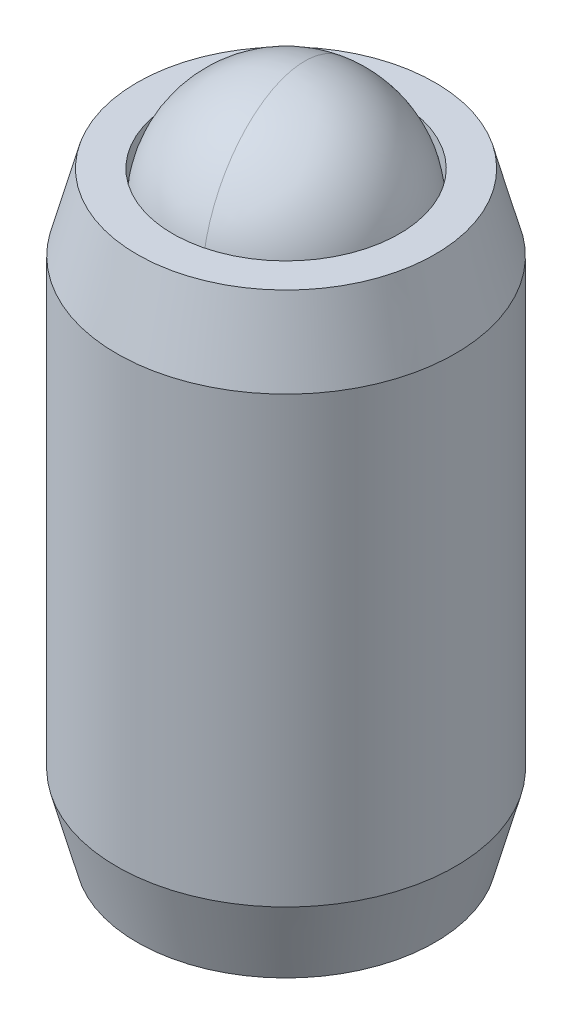
ISO-10303-21;
HEADER;
FILE_DESCRIPTION(('STEP AP214'),'2;1');
FILE_NAME('part.step','',(''),(''),'','','');
FILE_SCHEMA(('AUTOMOTIVE_DESIGN { 1 0 10303 214 1 1 1 1 }'));
ENDSEC;
DATA;
#1=APPLICATION_CONTEXT('core data for automotive mechanical design processes');
#2=APPLICATION_PROTOCOL_DEFINITION('international standard','automotive_design',2000,#1);
#3=PRODUCT_CONTEXT('',#1,'mechanical');
#4=PRODUCT('Part','Part','',(#3));
#5=PRODUCT_RELATED_PRODUCT_CATEGORY('part','',(#4));
#6=PRODUCT_DEFINITION_FORMATION('','',#4);
#7=PRODUCT_DEFINITION_CONTEXT('part definition',#1,'design');
#8=PRODUCT_DEFINITION('design','',#6,#7);
#9=PRODUCT_DEFINITION_SHAPE('','',#8);
#10=(LENGTH_UNIT() NAMED_UNIT(*) SI_UNIT(.MILLI.,.METRE.));
#11=(NAMED_UNIT(*) PLANE_ANGLE_UNIT() SI_UNIT($,.RADIAN.));
#12=(NAMED_UNIT(*) SI_UNIT($,.STERADIAN.) SOLID_ANGLE_UNIT());
#13=UNCERTAINTY_MEASURE_WITH_UNIT(LENGTH_MEASURE(1.E-05),#10,'distance_accuracy_value','');
#14=(GEOMETRIC_REPRESENTATION_CONTEXT(3) GLOBAL_UNCERTAINTY_ASSIGNED_CONTEXT((#13)) GLOBAL_UNIT_ASSIGNED_CONTEXT((#10,
#11,#12)) REPRESENTATION_CONTEXT('',''));
#15=CARTESIAN_POINT('',(0.,0.,0.));
#16=DIRECTION('',(0.,0.,1.));
#17=DIRECTION('',(1.,0.,0.));
#18=AXIS2_PLACEMENT_3D('',#15,#16,#17);
#19=CARTESIAN_POINT('',(3.71435257080567,-0.169252373948007,7.32758067099212));
#20=DIRECTION('',(0.,-1.,0.));
#21=DIRECTION('',(1.,0.,0.));
#22=AXIS2_PLACEMENT_3D('',#19,#20,#21);
#23=CONICAL_SURFACE('',#22,0.,0.78539816339745);
#24=CARTESIAN_POINT('',(3.71435257080567,-1.312252373948,7.32758067099212));
#25=DIRECTION('',(0.,1.,0.));
#26=DIRECTION('',(-1.,0.,0.));
#27=AXIS2_PLACEMENT_3D('',#24,#25,#26);
#28=CIRCLE('',#27,1.143);
#29=CARTESIAN_POINT('',(4.85734308213152,-1.312252373948,7.32292330917763));
#30=VERTEX_POINT('',#29);
#31=CARTESIAN_POINT('',(4.28988122011456,-1.312252373948,6.34005053280662));
#32=VERTEX_POINT('',#31);
#33=EDGE_CURVE('P0_E239',#30,#32,#28,.T.);
#34=ORIENTED_EDGE('',*,*,#33,.F.);
#35=CARTESIAN_POINT('',(4.85755257080567,-1.31246044025721,7.32328615420486));
#36=CARTESIAN_POINT('',(4.85754986438433,-1.31245775146451,7.3232814665456));
#37=CARTESIAN_POINT('',(4.85754715795709,-1.31245506269477,7.3232767788761));
#38=CARTESIAN_POINT('',(4.83805482766359,-1.29309011366432,7.28951507245068));
#39=CARTESIAN_POINT('',(4.81825873139563,-1.27491870956994,7.25522722792244));
#40=CARTESIAN_POINT('',(4.77799739364414,-1.24171882862372,7.18549254535573));
#41=CARTESIAN_POINT('',(4.75753178511991,-1.22669211031043,7.15004507158411));
#42=CARTESIAN_POINT('',(4.71600080261103,-1.20074837151425,7.07811129979059));
#43=CARTESIAN_POINT('',(4.69493706288189,-1.18982113088316,7.04162783238228));
#44=CARTESIAN_POINT('',(4.65231870342838,-1.17298459988489,6.96781066847354));
#45=CARTESIAN_POINT('',(4.63076462297386,-1.16707004690137,6.93047790601588));
#46=CARTESIAN_POINT('',(4.59359040392862,-1.16175968433041,6.86609026989785));
#47=CARTESIAN_POINT('',(4.57801755741396,-1.16099258245666,6.83911730851598));
#48=CARTESIAN_POINT('',(4.54690337232681,-1.16238845913065,6.78522595910893));
#49=CARTESIAN_POINT('',(4.53136204124561,-1.16455206746885,6.75830758405905));
#50=CARTESIAN_POINT('',(4.48495311681086,-1.17529458412025,6.67792496901343));
#51=CARTESIAN_POINT('',(4.45431847467133,-1.18812754847032,6.62486421235607));
#52=CARTESIAN_POINT('',(4.40110957793214,-1.21875261376539,6.53270369978911));
#53=CARTESIAN_POINT('',(4.37826334517805,-1.23479673860561,6.49313286389749));
#54=CARTESIAN_POINT('',(4.3333801606429,-1.27088743498856,6.41539290787712));
#55=CARTESIAN_POINT('',(4.31134330532398,-1.29093448178141,6.3772239548257));
#56=CARTESIAN_POINT('',(4.26825727765103,-1.3337310031301,6.30259676579983));
#57=CARTESIAN_POINT('',(4.24719984758599,-1.35644795012112,6.26612422705036));
#58=CARTESIAN_POINT('',(4.20577545952448,-1.40397145525448,6.19437508225537));
#59=CARTESIAN_POINT('',(4.18540637799066,-1.42877056660556,6.15909479813528));
#60=CARTESIAN_POINT('',(4.16528979504526,-1.45429891825988,6.12425185439917));
#61=B_SPLINE_CURVE_WITH_KNOTS('',3,(#35,#36,#37,#38,#39,#40,#41,#42,#43,#44,#45,#46,#47,#48,#49,
#50,#51,#52,#53,#54,#55,#56,#57,#58,#59,#60),.UNSPECIFIED.,.F.,.F.,(4,2,2,2,2,2,2,2,2,2,2,2,4),
(0.,1.81316377689297E-05,0.13058806615112,0.26123082266155,0.391545682806626,0.521723560618482,
0.615053768986273,0.708404036587446,0.895210399439815,1.04029045702031,1.18538774959988,
1.32887166801422,1.47186265945493),.UNSPECIFIED.);
#62=EDGE_CURVE('P0_E11',#30,#32,#61,.T.);
#63=ORIENTED_EDGE('',*,*,#62,.T.);
#64=EDGE_LOOP('',(#34,#63));
#65=FACE_BOUND('',#64,.T.);
#66=ADVANCED_FACE('P0_F17',(#65),#23,.F.);
#67=CARTESIAN_POINT('',(4.28181443282263,-1.312252373948,6.33539317099212));
#68=VERTEX_POINT('',#67);
#69=CARTESIAN_POINT('',(3.14689070878871,-1.312252373948,6.33539317099212));
#70=VERTEX_POINT('',#69);
#71=EDGE_CURVE('P0_E243',#68,#70,#28,.T.);
#72=ORIENTED_EDGE('',*,*,#71,.F.);
#73=CARTESIAN_POINT('',(2.57372176316856,-1.68103101994322,6.33539317099212));
#74=CARTESIAN_POINT('',(2.60150372982532,-1.66007283389546,6.33539317099212));
#75=CARTESIAN_POINT('',(2.62944069716268,-1.6393206926479,6.33539317099212));
#76=CARTESIAN_POINT('',(2.68568744790622,-1.59831355553451,6.33539317099212));
#77=CARTESIAN_POINT('',(2.71399732269767,-1.57805868514923,6.33539317099212));
#78=CARTESIAN_POINT('',(2.7999950069665,-1.51787856454166,6.33539317099212));
#79=CARTESIAN_POINT('',(2.85832845299474,-1.4788606224406,6.33539317099212));
#80=CARTESIAN_POINT('',(2.98063953213059,-1.4022805999482,6.33539317099212));
#81=CARTESIAN_POINT('',(3.04474949547022,-1.36492746348765,6.33539317099212));
#82=CARTESIAN_POINT('',(3.17616921465741,-1.29661239894251,6.33539317099212));
#83=CARTESIAN_POINT('',(3.24346720486202,-1.26562892762012,6.33539317099212));
#84=CARTESIAN_POINT('',(3.34449980237117,-1.22772408351047,6.33539317099212));
#85=CARTESIAN_POINT('',(3.37674251856021,-1.21684204174321,6.33539317099212));
#86=CARTESIAN_POINT('',(3.44200473919978,-1.19766674273306,6.33539317099212));
#87=CARTESIAN_POINT('',(3.47502429714999,-1.18937366435188,6.33539317099212));
#88=CARTESIAN_POINT('',(3.5410867615159,-1.175945731472,6.33539317099212));
#89=CARTESIAN_POINT('',(3.5741184243205,-1.17075642188746,6.33539317099212));
#90=CARTESIAN_POINT('',(3.64054375640494,-1.16363372601876,6.33539317099212));
#91=CARTESIAN_POINT('',(3.67393748056284,-1.16170084045924,6.33539317099212));
#92=CARTESIAN_POINT('',(3.73954685398962,-1.16123692460889,6.33539317099212));
#93=CARTESIAN_POINT('',(3.7717616978466,-1.16258609816448,6.33539317099212));
#94=CARTESIAN_POINT('',(3.83590382532484,-1.16834705721685,6.33539317099212));
#95=CARTESIAN_POINT('',(3.86783117322682,-1.17275813997068,6.33539317099212));
#96=CARTESIAN_POINT('',(3.93172366681495,-1.18447722315108,6.33539317099212));
#97=CARTESIAN_POINT('',(3.96367955978926,-1.19183491392615,6.33539317099212));
#98=CARTESIAN_POINT('',(4.02689335168815,-1.20905668681501,6.33539317099212));
#99=CARTESIAN_POINT('',(4.05815130940814,-1.21892055693022,6.33539317099212));
#100=CARTESIAN_POINT('',(4.15664812524377,-1.25371093295435,6.33539317099212));
#101=CARTESIAN_POINT('',(4.22248283967945,-1.28260315858406,6.33539317099212));
#102=CARTESIAN_POINT('',(4.35105872838445,-1.3468390583077,6.33539317099212));
#103=CARTESIAN_POINT('',(4.41378771559752,-1.38220592765967,6.33539317099212));
#104=CARTESIAN_POINT('',(4.53367058628006,-1.45516824363566,6.33539317099212));
#105=CARTESIAN_POINT('',(4.59094659859076,-1.49256550481214,6.33539317099212));
#106=CARTESIAN_POINT('',(4.67533131614639,-1.55037667290736,6.33539317099212));
#107=CARTESIAN_POINT('',(4.70309531571387,-1.56985068399867,6.33539317099212));
#108=CARTESIAN_POINT('',(4.75824399077057,-1.60931345693125,6.33539317099212));
#109=CARTESIAN_POINT('',(4.78562876790362,-1.62930207656683,6.33539317099212));
#110=CARTESIAN_POINT('',(4.81285565499193,-1.64950406238581,6.33539317099212));
#111=B_SPLINE_CURVE_WITH_KNOTS('',3,(#73,#74,#75,#76,#77,#78,#79,#80,#81,#82,#83,#84,#85,#86,
#87,#88,#89,#90,#91,#92,#93,#94,#95,#96,#97,#98,#99,#100,#101,#102,#103,#104,#105,#106,#107,
#108,#109,#110),.UNSPECIFIED.,.F.,.F.,(4,2,2,2,2,2,2,2,2,2,2,2,2,2,2,2,2,2,4),(0.,
0.104399205750146,0.20882449015393,0.4192690376076,0.641680044169887,0.863325974887584,
0.965328311414921,1.06733769333986,1.16750041530699,1.26767853740811,1.3642553320756,
1.46080996859686,1.55906646638462,1.65731465538659,1.87236816316003,2.08820773237251,
2.29331760239731,2.39505206150513,2.49675870307946),.UNSPECIFIED.);
#112=EDGE_CURVE('P0_E30',#68,#70,#111,.F.);
#113=ORIENTED_EDGE('',*,*,#112,.T.);
#114=EDGE_LOOP('',(#72,#113));
#115=FACE_BOUND('',#114,.T.);
#116=ADVANCED_FACE('P0_F230',(#115),#23,.F.);
#117=CARTESIAN_POINT('',(3.13882392149677,-1.312252373948,6.34005053280662));
#118=VERTEX_POINT('',#117);
#119=CARTESIAN_POINT('',(2.57136205947982,-1.312252373948,7.32292330917763));
#120=VERTEX_POINT('',#119);
#121=EDGE_CURVE('P0_E162',#118,#120,#28,.T.);
#122=ORIENTED_EDGE('',*,*,#121,.F.);
#123=CARTESIAN_POINT('',(3.26341534656608,-1.45429891825988,6.12425185439917));
#124=CARTESIAN_POINT('',(3.24343759340995,-1.42894522835127,6.15885433788667));
#125=CARTESIAN_POINT('',(3.22320845147875,-1.40431002062132,6.19389223950502));
#126=CARTESIAN_POINT('',(3.18179090792657,-1.35675647710123,6.26562952926209));
#127=CARTESIAN_POINT('',(3.16059198952446,-1.3338749800858,6.30234713300005));
#128=CARTESIAN_POINT('',(3.11945187209737,-1.29300973005343,6.37360390661313));
#129=CARTESIAN_POINT('',(3.09957551484011,-1.27476876619436,6.40803076725208));
#130=CARTESIAN_POINT('',(3.05915205026837,-1.2414646952883,6.47804626170831));
#131=CARTESIAN_POINT('',(3.03860481589536,-1.2264021942943,6.51363511559737));
#132=CARTESIAN_POINT('',(2.9970680987738,-1.20052561737435,6.58557882003154));
#133=CARTESIAN_POINT('',(2.97608526696165,-1.18966976423615,6.62192215081685));
#134=CARTESIAN_POINT('',(2.9336315074221,-1.17293830977722,6.69545421931167));
#135=CARTESIAN_POINT('',(2.91216106622551,-1.16705795036444,6.73264211432507));
#136=CARTESIAN_POINT('',(2.87508221121632,-1.1617612802309,6.79686457508748));
#137=CARTESIAN_POINT('',(2.85952040313229,-1.16099365163671,6.82381841734665));
#138=CARTESIAN_POINT('',(2.8284281507379,-1.16238443031327,6.87767177821549));
#139=CARTESIAN_POINT('',(2.81289771375483,-1.1645434563006,6.90457128413391));
#140=CARTESIAN_POINT('',(2.76647746556835,-1.1752764305586,6.98497351249285));
#141=CARTESIAN_POINT('',(2.7358212112753,-1.18811455442499,7.03807170249816));
#142=CARTESIAN_POINT('',(2.6826041173518,-1.21874503163673,7.13024641300483));
#143=CARTESIAN_POINT('',(2.6597703232217,-1.23477928247632,7.16979570456774));
#144=CARTESIAN_POINT('',(2.62611488331747,-1.26183638471471,7.22808863643294));
#145=CARTESIAN_POINT('',(2.61498692161902,-1.27136522965478,7.24736283147935));
#146=CARTESIAN_POINT('',(2.59292890112993,-1.29129000483631,7.28556844368084));
#147=CARTESIAN_POINT('',(2.58199881718583,-1.30168582391591,7.30449990440302));
#148=CARTESIAN_POINT('',(2.54792046091,-1.33553912020257,7.36352534891118));
#149=CARTESIAN_POINT('',(2.52510305258668,-1.36033050059066,7.40304625942421));
#150=CARTESIAN_POINT('',(2.48017571748318,-1.41237244073279,7.48086268647215));
#151=CARTESIAN_POINT('',(2.45806621813538,-1.43962444963929,7.51915746267245));
#152=CARTESIAN_POINT('',(2.41436568918583,-1.49600788150844,7.59484899913071));
#153=CARTESIAN_POINT('',(2.39277638199246,-1.52514461294509,7.63224277608985));
#154=CARTESIAN_POINT('',(2.35006936753153,-1.58477360733416,7.70621349497575));
#155=CARTESIAN_POINT('',(2.32895173425738,-1.61526608075448,7.74279030874219));
#156=CARTESIAN_POINT('',(2.26744149242511,-1.70638490348129,7.84932917278152));
#157=CARTESIAN_POINT('',(2.22757102665993,-1.76841913306521,7.91838684520824));
#158=CARTESIAN_POINT('',(2.16863391199773,-1.86300843677273,8.02046892225469));
#159=CARTESIAN_POINT('',(2.1492036716343,-1.89467389645117,8.05412308576743));
#160=CARTESIAN_POINT('',(2.11054742089055,-1.95848440506911,8.12107767608573));
#161=CARTESIAN_POINT('',(2.09132137057102,-1.99062935714879,8.15437817206803));
#162=CARTESIAN_POINT('',(2.07217682928921,-2.02296942275105,8.18753749025572));
#163=B_SPLINE_CURVE_WITH_KNOTS('',3,(#123,#124,#125,#126,#127,#128,#129,#130,#131,#132,#133,
#134,#135,#136,#137,#138,#139,#140,#141,#142,#143,#144,#145,#146,#147,#148,#149,#150,#151,#152,
#153,#154,#155,#156,#157,#158,#159,#160,#161,#162),.UNSPECIFIED.,.F.,.F.,(4,2,2,2,2,2,2,2,2,2,2,
2,2,2,2,2,2,2,2,4),(0.,0.142015492124799,0.28647478580431,0.417582578490739,0.548715347595038,
0.678510217108265,0.80818082233291,0.901445197909852,0.994729293345569,1.18166731759611,
1.32665810540211,1.39927013153265,1.47187286175303,1.62755511883544,1.78332966839058,
1.9395638764213,2.09582242380832,2.39881912123289,2.54920251539601,2.69955593206453),.UNSPECIFIED.);
#164=EDGE_CURVE('P0_E256',#118,#120,#163,.T.);
#165=ORIENTED_EDGE('',*,*,#164,.T.);
#166=EDGE_LOOP('',(#122,#165));
#167=FACE_BOUND('',#166,.T.);
#168=ADVANCED_FACE('P0_F235',(#167),#23,.F.);
#169=CARTESIAN_POINT('',(2.57136205947982,-1.312252373948,7.33223803280662));
#170=VERTEX_POINT('',#169);
#171=CARTESIAN_POINT('',(3.13882392149677,-1.312252373948,8.31511080917763));
#172=VERTEX_POINT('',#171);
#173=EDGE_CURVE('P0_E173',#170,#172,#28,.T.);
#174=ORIENTED_EDGE('',*,*,#173,.F.);
#175=CARTESIAN_POINT('',(2.57115257080567,-1.31246044025721,7.33187518777938));
#176=CARTESIAN_POINT('',(2.57115527722701,-1.31245775146451,7.33187987543865));
#177=CARTESIAN_POINT('',(2.57115798365426,-1.31245506269477,7.33188456310815));
#178=CARTESIAN_POINT('',(2.5906503139484,-1.2930901136647,7.36564626953345));
#179=CARTESIAN_POINT('',(2.61044641021591,-1.27491870957002,7.39993411406182));
#180=CARTESIAN_POINT('',(2.65070774796708,-1.24171882862358,7.46966879662864));
#181=CARTESIAN_POINT('',(2.67117335649144,-1.22669211031036,7.50511627040024));
#182=CARTESIAN_POINT('',(2.7127043390004,-1.20074837151425,7.57705004219373));
#183=CARTESIAN_POINT('',(2.73376807872949,-1.18982113088315,7.61353350960202));
#184=CARTESIAN_POINT('',(2.77638643818295,-1.17298459988488,7.68735067351073));
#185=CARTESIAN_POINT('',(2.79794051863749,-1.16707004690137,7.72468343596838));
#186=CARTESIAN_POINT('',(2.83511473768271,-1.16175968433041,7.78907107208639));
#187=CARTESIAN_POINT('',(2.85068758419737,-1.16099258245666,7.81604403346824));
#188=CARTESIAN_POINT('',(2.88180176928451,-1.16238845913065,7.86993538287528));
#189=CARTESIAN_POINT('',(2.8973431003657,-1.16455206746884,7.89685375792515));
#190=CARTESIAN_POINT('',(2.94375202480046,-1.17529458412025,7.97723637297078));
#191=CARTESIAN_POINT('',(2.97438666694,-1.18812754847031,8.03029712962815));
#192=CARTESIAN_POINT('',(3.0275955636792,-1.21875261376539,8.12245764219514));
#193=CARTESIAN_POINT('',(3.05044179643329,-1.23479673860562,8.16202847808677));
#194=CARTESIAN_POINT('',(3.09532498096844,-1.27088743498857,8.23976843410714));
#195=CARTESIAN_POINT('',(3.11736183628736,-1.29093448178142,8.27793738715855));
#196=CARTESIAN_POINT('',(3.16044786396031,-1.3337310031301,8.35256457618441));
#197=CARTESIAN_POINT('',(3.18150529402534,-1.35644795012112,8.38903711493387));
#198=CARTESIAN_POINT('',(3.22292968208685,-1.40397145525447,8.46078625972886));
#199=CARTESIAN_POINT('',(3.24329876362068,-1.42877056660555,8.49606654384896));
#200=CARTESIAN_POINT('',(3.26341534656608,-1.45429891825988,8.53090948758508));
#201=B_SPLINE_CURVE_WITH_KNOTS('',3,(#175,#176,#177,#178,#179,#180,#181,#182,#183,#184,#185,
#186,#187,#188,#189,#190,#191,#192,#193,#194,#195,#196,#197,#198,#199,#200),.UNSPECIFIED.,.F.,
.F.,(4,2,2,2,2,2,2,2,2,2,2,2,4),(0.,1.81316377712436E-05,0.130588066151212,0.261230822661675,
0.39154568280666,0.521723560618482,0.615053768986239,0.708404036587377,0.895210399439815,
1.04029045702034,1.18538774959988,1.3288716680142,1.47186265945493),.UNSPECIFIED.);
#202=EDGE_CURVE('P0_E258',#170,#172,#201,.T.);
#203=ORIENTED_EDGE('',*,*,#202,.T.);
#204=EDGE_LOOP('',(#174,#203));
#205=FACE_BOUND('',#204,.T.);
#206=ADVANCED_FACE('P0_F292',(#205),#23,.F.);
#207=CARTESIAN_POINT('',(3.14689070878871,-1.312252373948,8.31976817099212));
#208=VERTEX_POINT('',#207);
#209=CARTESIAN_POINT('',(4.28181443282263,-1.312252373948,8.31976817099212));
#210=VERTEX_POINT('',#209);
#211=EDGE_CURVE('P0_E177',#208,#210,#28,.T.);
#212=ORIENTED_EDGE('',*,*,#211,.F.);
#213=CARTESIAN_POINT('',(2.57372176316856,-1.68103101994322,8.31976817099212));
#214=CARTESIAN_POINT('',(2.60150372982532,-1.66007283389546,8.31976817099212));
#215=CARTESIAN_POINT('',(2.62944069716268,-1.6393206926479,8.31976817099212));
#216=CARTESIAN_POINT('',(2.68568744790622,-1.59831355553451,8.31976817099212));
#217=CARTESIAN_POINT('',(2.71399732269767,-1.57805868514923,8.31976817099212));
#218=CARTESIAN_POINT('',(2.7999950069665,-1.51787856454166,8.31976817099212));
#219=CARTESIAN_POINT('',(2.85832845299474,-1.4788606224406,8.31976817099212));
#220=CARTESIAN_POINT('',(2.98063953213059,-1.4022805999482,8.31976817099212));
#221=CARTESIAN_POINT('',(3.04474949547022,-1.36492746348765,8.31976817099212));
#222=CARTESIAN_POINT('',(3.1761692146574,-1.29661239894251,8.31976817099212));
#223=CARTESIAN_POINT('',(3.24346720486202,-1.26562892762012,8.31976817099212));
#224=CARTESIAN_POINT('',(3.34449980237117,-1.22772408351047,8.31976817099212));
#225=CARTESIAN_POINT('',(3.37674251856021,-1.21684204174321,8.31976817099212));
#226=CARTESIAN_POINT('',(3.44200473919978,-1.19766674273306,8.31976817099212));
#227=CARTESIAN_POINT('',(3.47502429714999,-1.18937366435188,8.31976817099212));
#228=CARTESIAN_POINT('',(3.5410867615159,-1.175945731472,8.31976817099212));
#229=CARTESIAN_POINT('',(3.5741184243205,-1.17075642188746,8.31976817099212));
#230=CARTESIAN_POINT('',(3.64054375640494,-1.16363372601876,8.31976817099212));
#231=CARTESIAN_POINT('',(3.67393748056284,-1.16170084045924,8.31976817099212));
#232=CARTESIAN_POINT('',(3.73954685398962,-1.16123692460889,8.31976817099212));
#233=CARTESIAN_POINT('',(3.7717616978466,-1.16258609816448,8.31976817099212));
#234=CARTESIAN_POINT('',(3.83590382532484,-1.16834705721685,8.31976817099212));
#235=CARTESIAN_POINT('',(3.86783117322682,-1.17275813997068,8.31976817099212));
#236=CARTESIAN_POINT('',(3.93172366681495,-1.18447722315108,8.31976817099212));
#237=CARTESIAN_POINT('',(3.96367955978926,-1.19183491392615,8.31976817099212));
#238=CARTESIAN_POINT('',(4.02689335168815,-1.20905668681501,8.31976817099212));
#239=CARTESIAN_POINT('',(4.05815130940814,-1.21892055693022,8.31976817099212));
#240=CARTESIAN_POINT('',(4.15664812524377,-1.25371093295435,8.31976817099212));
#241=CARTESIAN_POINT('',(4.22248283967946,-1.28260315858406,8.31976817099212));
#242=CARTESIAN_POINT('',(4.35105872838445,-1.3468390583077,8.31976817099212));
#243=CARTESIAN_POINT('',(4.41378771559752,-1.38220592765967,8.31976817099212));
#244=CARTESIAN_POINT('',(4.53367058628006,-1.45516824363566,8.31976817099212));
#245=CARTESIAN_POINT('',(4.59094659859076,-1.49256550481214,8.31976817099212));
#246=CARTESIAN_POINT('',(4.67533131614639,-1.55037667290736,8.31976817099212));
#247=CARTESIAN_POINT('',(4.70309531571387,-1.56985068399867,8.31976817099212));
#248=CARTESIAN_POINT('',(4.75824399077057,-1.60931345693125,8.31976817099212));
#249=CARTESIAN_POINT('',(4.78562876790362,-1.62930207656683,8.31976817099212));
#250=CARTESIAN_POINT('',(4.81285565499193,-1.64950406238581,8.31976817099212));
#251=B_SPLINE_CURVE_WITH_KNOTS('',3,(#213,#214,#215,#216,#217,#218,#219,#220,#221,#222,#223,
#224,#225,#226,#227,#228,#229,#230,#231,#232,#233,#234,#235,#236,#237,#238,#239,#240,#241,#242,
#243,#244,#245,#246,#247,#248,#249,#250),.UNSPECIFIED.,.F.,.F.,(4,2,2,2,2,2,2,2,2,2,2,2,2,2,2,2,
2,2,4),(0.,0.104399205750145,0.208824490153929,0.419269037607599,0.641680044169886,
0.863325974887583,0.96532831141492,1.06733769333986,1.16750041530699,1.26767853740811,
1.3642553320756,1.46080996859686,1.55906646638462,1.65731465538659,1.87236816316003,
2.08820773237251,2.29331760239731,2.39505206150513,2.49675870307946),.UNSPECIFIED.);
#252=EDGE_CURVE('P0_E201',#208,#210,#251,.T.);
#253=ORIENTED_EDGE('',*,*,#252,.T.);
#254=EDGE_LOOP('',(#212,#253));
#255=FACE_BOUND('',#254,.T.);
#256=ADVANCED_FACE('P0_F228',(#255),#23,.F.);
#257=CARTESIAN_POINT('',(3.71435257080567,5.96768359578472,7.32758067099212));
#258=DIRECTION('',(0.,1.,0.));
#259=DIRECTION('',(-1.,0.,0.));
#260=AXIS2_PLACEMENT_3D('',#257,#258,#259);
#261=CONICAL_SURFACE('',#260,1.59385,0.785398163397443);
#262=CARTESIAN_POINT('',(3.71435257080567,4.3738335957847,7.32758067099212));
#263=VERTEX_POINT('',#262);
#264=VERTEX_LOOP('',#263);
#265=FACE_BOUND('',#264,.T.);
#266=CARTESIAN_POINT('',(3.71435257080567,5.96768359578472,7.32758067099212));
#267=DIRECTION('',(0.,1.,0.));
#268=DIRECTION('',(-1.,0.,0.));
#269=AXIS2_PLACEMENT_3D('',#266,#267,#268);
#270=CIRCLE('',#269,1.59385);
#271=CARTESIAN_POINT('',(2.12050257080567,5.96768359578472,7.32758067099212));
#272=VERTEX_POINT('',#271);
#273=EDGE_CURVE('P0_E192',#272,#272,#270,.T.);
#274=ORIENTED_EDGE('',*,*,#273,.T.);
#275=EDGE_LOOP('',(#274));
#276=FACE_BOUND('',#275,.T.);
#277=ADVANCED_FACE('P0_F19',(#265,#276),#261,.F.);
#278=CARTESIAN_POINT('',(3.71435257080567,4.3738335957847,7.32758067099212));
#279=DIRECTION('',(0.,1.,0.));
#280=DIRECTION('',(-1.,0.,0.));
#281=AXIS2_PLACEMENT_3D('',#278,#279,#280);
#282=CYLINDRICAL_SURFACE('',#281,1.59385);
#283=ORIENTED_EDGE('',*,*,#273,.F.);
#284=EDGE_LOOP('',(#283));
#285=FACE_BOUND('',#284,.T.);
#286=CARTESIAN_POINT('',(3.71435257080567,7.069747626052,7.32758067099212));
#287=DIRECTION('',(0.,1.,0.));
#288=DIRECTION('',(-1.,0.,0.));
#289=AXIS2_PLACEMENT_3D('',#286,#287,#288);
#290=CIRCLE('',#289,1.59385);
#291=CARTESIAN_POINT('',(2.12050257080567,7.069747626052,7.32758067099212));
#292=VERTEX_POINT('',#291);
#293=EDGE_CURVE('P0_E189',#292,#292,#290,.T.);
#294=ORIENTED_EDGE('',*,*,#293,.T.);
#295=EDGE_LOOP('',(#294));
#296=FACE_BOUND('',#295,.T.);
#297=ADVANCED_FACE('P0_F337',(#285,#296),#282,.F.);
#298=CARTESIAN_POINT('',(5.30820257080567,7.069747626052,7.32758067099212));
#299=DIRECTION('',(0.,-1.,0.));
#300=DIRECTION('',(1.,0.,0.));
#301=AXIS2_PLACEMENT_3D('',#298,#299,#300);
#302=PLANE('',#301);
#303=ORIENTED_EDGE('',*,*,#293,.F.);
#304=EDGE_LOOP('',(#303));
#305=FACE_BOUND('',#304,.T.);
#306=CARTESIAN_POINT('',(3.71435257080567,7.069747626052,7.32758067099212));
#307=DIRECTION('',(0.,1.,0.));
#308=DIRECTION('',(-1.,0.,0.));
#309=AXIS2_PLACEMENT_3D('',#306,#307,#308);
#310=CIRCLE('',#309,2.0955);
#311=CARTESIAN_POINT('',(1.61885257080567,7.069747626052,7.32758067099212));
#312=VERTEX_POINT('',#311);
#313=EDGE_CURVE('P0_E186',#312,#312,#310,.T.);
#314=ORIENTED_EDGE('',*,*,#313,.T.);
#315=EDGE_LOOP('',(#314));
#316=FACE_BOUND('',#315,.T.);
#317=ADVANCED_FACE('P0_F344',(#305,#316),#302,.F.);
#318=CARTESIAN_POINT('',(3.71435257080567,6.00331410778921,7.32758067099212));
#319=DIRECTION('',(0.,-1.,0.));
#320=DIRECTION('',(1.,0.,0.));
#321=AXIS2_PLACEMENT_3D('',#318,#319,#320);
#322=CONICAL_SURFACE('',#321,2.38125,0.261799387799151);
#323=ORIENTED_EDGE('',*,*,#313,.F.);
#324=EDGE_LOOP('',(#323));
#325=FACE_BOUND('',#324,.T.);
#326=CARTESIAN_POINT('',(3.71435257080567,6.00331410778921,7.32758067099212));
#327=DIRECTION('',(0.,1.,0.));
#328=DIRECTION('',(-1.,0.,0.));
#329=AXIS2_PLACEMENT_3D('',#326,#327,#328);
#330=CIRCLE('',#329,2.38125);
#331=CARTESIAN_POINT('',(1.33310257080567,6.00331410778921,7.32758067099212));
#332=VERTEX_POINT('',#331);
#333=EDGE_CURVE('P0_E183',#332,#332,#330,.T.);
#334=ORIENTED_EDGE('',*,*,#333,.T.);
#335=EDGE_LOOP('',(#334));
#336=FACE_BOUND('',#335,.T.);
#337=ADVANCED_FACE('P0_F352',(#325,#336),#322,.T.);
#338=CARTESIAN_POINT('',(3.71435257080567,4.3738335957847,7.32758067099212));
#339=DIRECTION('',(0.,1.,0.));
#340=DIRECTION('',(-1.,0.,0.));
#341=AXIS2_PLACEMENT_3D('',#338,#339,#340);
#342=CYLINDRICAL_SURFACE('',#341,2.38125);
#343=ORIENTED_EDGE('',*,*,#333,.F.);
#344=EDGE_LOOP('',(#343));
#345=FACE_BOUND('',#344,.T.);
#346=CARTESIAN_POINT('',(3.71435257080567,-0.245818855685202,7.32758067099212));
#347=DIRECTION('',(0.,1.,0.));
#348=DIRECTION('',(-1.,0.,0.));
#349=AXIS2_PLACEMENT_3D('',#346,#347,#348);
#350=CIRCLE('',#349,2.38125);
#351=CARTESIAN_POINT('',(1.33310257080567,-0.245818855685202,7.32758067099212));
#352=VERTEX_POINT('',#351);
#353=EDGE_CURVE('P0_E180',#352,#352,#350,.T.);
#354=ORIENTED_EDGE('',*,*,#353,.T.);
#355=EDGE_LOOP('',(#354));
#356=FACE_BOUND('',#355,.T.);
#357=ADVANCED_FACE('P0_F361',(#345,#356),#342,.T.);
#358=CARTESIAN_POINT('',(3.71435257080567,-1.312252373948,7.32758067099212));
#359=DIRECTION('',(0.,1.,0.));
#360=DIRECTION('',(-1.,0.,0.));
#361=AXIS2_PLACEMENT_3D('',#358,#359,#360);
#362=CONICAL_SURFACE('',#361,2.0955,0.261799387799151);
#363=ORIENTED_EDGE('',*,*,#353,.F.);
#364=EDGE_LOOP('',(#363));
#365=FACE_BOUND('',#364,.T.);
#366=CARTESIAN_POINT('',(3.71435257080567,-1.312252373948,7.32758067099212));
#367=DIRECTION('',(0.,1.,0.));
#368=DIRECTION('',(-1.,0.,0.));
#369=AXIS2_PLACEMENT_3D('',#366,#367,#368);
#370=CIRCLE('',#369,2.0955);
#371=CARTESIAN_POINT('',(1.61885257080567,-1.312252373948,7.32758067099212));
#372=VERTEX_POINT('',#371);
#373=EDGE_CURVE('P0_E176',#372,#372,#370,.T.);
#374=ORIENTED_EDGE('',*,*,#373,.T.);
#375=EDGE_LOOP('',(#374));
#376=FACE_BOUND('',#375,.T.);
#377=ADVANCED_FACE('P0_F370',(#365,#376),#362,.T.);
#378=CARTESIAN_POINT('',(5.80985257080567,-1.312252373948,7.32758067099212));
#379=DIRECTION('',(0.,1.,0.));
#380=DIRECTION('',(-1.,0.,0.));
#381=AXIS2_PLACEMENT_3D('',#378,#379,#380);
#382=PLANE('',#381);
#383=ORIENTED_EDGE('',*,*,#373,.F.);
#384=EDGE_LOOP('',(#383));
#385=FACE_BOUND('',#384,.T.);
#386=ORIENTED_EDGE('',*,*,#33,.T.);
#387=DIRECTION('',(0.5,0.,0.866025403784439));
#388=VECTOR('',#387,1.);
#389=CARTESIAN_POINT('',(4.28719229101725,-1.312252373948,6.33539317099212));
#390=LINE('',#389,#388);
#391=CARTESIAN_POINT('',(4.28719229101725,-1.312252373948,6.33539317099212));
#392=VERTEX_POINT('',#391);
#393=EDGE_CURVE('P0_E147',#392,#32,#390,.T.);
#394=ORIENTED_EDGE('',*,*,#393,.F.);
#395=DIRECTION('',(1.,0.,0.));
#396=VECTOR('',#395,1.);
#397=CARTESIAN_POINT('',(3.14151285059409,-1.312252373948,6.33539317099212));
#398=LINE('',#397,#396);
#399=EDGE_CURVE('P0_E137',#68,#392,#398,.T.);
#400=ORIENTED_EDGE('',*,*,#399,.F.);
#401=ORIENTED_EDGE('',*,*,#71,.T.);
#402=CARTESIAN_POINT('',(3.14151285059409,-1.312252373948,6.33539317099212));
#403=VERTEX_POINT('',#402);
#404=EDGE_CURVE('P0_E135',#403,#70,#398,.T.);
#405=ORIENTED_EDGE('',*,*,#404,.F.);
#406=DIRECTION('',(0.5,0.,-0.866025403784439));
#407=VECTOR('',#406,1.);
#408=CARTESIAN_POINT('',(2.56867313038251,-1.312252373948,7.32758067099212));
#409=LINE('',#408,#407);
#410=EDGE_CURVE('P0_E157',#118,#403,#409,.T.);
#411=ORIENTED_EDGE('',*,*,#410,.F.);
#412=ORIENTED_EDGE('',*,*,#121,.T.);
#413=CARTESIAN_POINT('',(2.56867313038251,-1.312252373948,7.32758067099212));
#414=VERTEX_POINT('',#413);
#415=EDGE_CURVE('P0_E158',#414,#120,#409,.T.);
#416=ORIENTED_EDGE('',*,*,#415,.F.);
#417=DIRECTION('',(-0.5,0.,-0.866025403784439));
#418=VECTOR('',#417,1.);
#419=CARTESIAN_POINT('',(3.14151285059409,-1.312252373948,8.31976817099212));
#420=LINE('',#419,#418);
#421=EDGE_CURVE('P0_E154',#170,#414,#420,.T.);
#422=ORIENTED_EDGE('',*,*,#421,.F.);
#423=ORIENTED_EDGE('',*,*,#173,.T.);
#424=CARTESIAN_POINT('',(3.14151285059409,-1.312252373948,8.31976817099212));
#425=VERTEX_POINT('',#424);
#426=EDGE_CURVE('P0_E155',#425,#172,#420,.T.);
#427=ORIENTED_EDGE('',*,*,#426,.F.);
#428=DIRECTION('',(-1.,0.,0.));
#429=VECTOR('',#428,1.);
#430=CARTESIAN_POINT('',(4.28719229101725,-1.312252373948,8.31976817099212));
#431=LINE('',#430,#429);
#432=EDGE_CURVE('P0_E151',#208,#425,#431,.T.);
#433=ORIENTED_EDGE('',*,*,#432,.F.);
#434=ORIENTED_EDGE('',*,*,#211,.T.);
#435=CARTESIAN_POINT('',(4.28719229101725,-1.312252373948,8.31976817099212));
#436=VERTEX_POINT('',#435);
#437=EDGE_CURVE('P0_E152',#436,#210,#431,.T.);
#438=ORIENTED_EDGE('',*,*,#437,.F.);
#439=DIRECTION('',(-0.5,0.,0.866025403784438));
#440=VECTOR('',#439,1.);
#441=CARTESIAN_POINT('',(4.86003201122883,-1.312252373948,7.32758067099212));
#442=LINE('',#441,#440);
#443=CARTESIAN_POINT('',(4.28988122011456,-1.312252373948,8.31511080917763));
#444=VERTEX_POINT('',#443);
#445=EDGE_CURVE('P0_E149',#444,#436,#442,.T.);
#446=ORIENTED_EDGE('',*,*,#445,.F.);
#447=CARTESIAN_POINT('',(4.85734308213152,-1.312252373948,7.33223803280662));
#448=VERTEX_POINT('',#447);
#449=EDGE_CURVE('P0_E242',#444,#448,#28,.T.);
#450=ORIENTED_EDGE('',*,*,#449,.T.);
#451=CARTESIAN_POINT('',(4.86003201122883,-1.312252373948,7.32758067099212));
#452=VERTEX_POINT('',#451);
#453=EDGE_CURVE('P0_E37',#452,#448,#442,.T.);
#454=ORIENTED_EDGE('',*,*,#453,.F.);
#455=EDGE_CURVE('P0_E119',#30,#452,#390,.T.);
#456=ORIENTED_EDGE('',*,*,#455,.F.);
#457=EDGE_LOOP('',(#386,#394,#400,#401,#405,#411,#412,#416,#422,#423,#427,#433,#434,#438,#446,
#450,#454,#456));
#458=FACE_BOUND('',#457,.T.);
#459=ADVANCED_FACE('P0_F226',(#385,#458),#382,.F.);
#460=ORIENTED_EDGE('',*,*,#449,.F.);
#461=CARTESIAN_POINT('',(4.16528979504526,-1.45429891825988,8.53090948758508));
#462=CARTESIAN_POINT('',(4.18526754820139,-1.42894522835127,8.49630700409758));
#463=CARTESIAN_POINT('',(4.20549669013259,-1.40431002062132,8.46126910247922));
#464=CARTESIAN_POINT('',(4.24691423368477,-1.35675647710123,8.38953181272215));
#465=CARTESIAN_POINT('',(4.26811315208688,-1.3338749800858,8.35281420898419));
#466=CARTESIAN_POINT('',(4.30925326951397,-1.29300973005343,8.28155743537112));
#467=CARTESIAN_POINT('',(4.32912962677122,-1.27476876619437,8.24713057473217));
#468=CARTESIAN_POINT('',(4.36955309134297,-1.2414646952883,8.17711508027594));
#469=CARTESIAN_POINT('',(4.39010032571597,-1.2264021942943,8.14152622638687));
#470=CARTESIAN_POINT('',(4.43163704283754,-1.20052561737435,8.06958252195271));
#471=CARTESIAN_POINT('',(4.45261987464968,-1.18966976423615,8.0332391911674));
#472=CARTESIAN_POINT('',(4.49507363418924,-1.17293830977722,7.95970712267257));
#473=CARTESIAN_POINT('',(4.51654407538582,-1.16705795036444,7.92251922765917));
#474=CARTESIAN_POINT('',(4.55362293039502,-1.1617612802309,7.85829676689677));
#475=CARTESIAN_POINT('',(4.56918473847905,-1.16099365163671,7.83134292463759));
#476=CARTESIAN_POINT('',(4.60027699087344,-1.16238443031327,7.77748956376875));
#477=CARTESIAN_POINT('',(4.61580742785651,-1.1645434563006,7.75059005785033));
#478=CARTESIAN_POINT('',(4.66222767604299,-1.1752764305586,7.67018782949139));
#479=CARTESIAN_POINT('',(4.69288393033603,-1.18811455442499,7.61708963948608));
#480=CARTESIAN_POINT('',(4.74610102425954,-1.21874503163673,7.52491492897941));
#481=CARTESIAN_POINT('',(4.76893481838964,-1.23477928247632,7.48536563741651));
#482=CARTESIAN_POINT('',(4.80259025829387,-1.26183638471471,7.4270727055513));
#483=CARTESIAN_POINT('',(4.81371821999232,-1.27136522965478,7.4077985105049));
#484=CARTESIAN_POINT('',(4.83577624048141,-1.29129000483631,7.3695928983034));
#485=CARTESIAN_POINT('',(4.84670632442551,-1.30168582391591,7.35066143758122));
#486=CARTESIAN_POINT('',(4.88078468070134,-1.33553912020257,7.29163599307306));
#487=CARTESIAN_POINT('',(4.90360208902466,-1.36033050059066,7.25211508256003));
#488=CARTESIAN_POINT('',(4.94852942412816,-1.4123724407328,7.17429865551209));
#489=CARTESIAN_POINT('',(4.97063892347596,-1.43962444963929,7.13600387931179));
#490=CARTESIAN_POINT('',(5.01433945242551,-1.49600788150844,7.06031234285353));
#491=CARTESIAN_POINT('',(5.03592875961888,-1.52514461294509,7.0229185658944));
#492=CARTESIAN_POINT('',(5.07863577407981,-1.58477360733416,6.94894784700849));
#493=CARTESIAN_POINT('',(5.09975340735396,-1.61526608075448,6.91237103324205));
#494=CARTESIAN_POINT('',(5.16126364918623,-1.70638490348129,6.80583216920272));
#495=CARTESIAN_POINT('',(5.20113411495141,-1.76841913306521,6.736774496776));
#496=CARTESIAN_POINT('',(5.26007122961361,-1.86300843677274,6.63469241972955));
#497=CARTESIAN_POINT('',(5.27950146997704,-1.89467389645117,6.60103825621681));
#498=CARTESIAN_POINT('',(5.31815772072079,-1.95848440506912,6.53408366589851));
#499=CARTESIAN_POINT('',(5.33738377104032,-1.9906293571488,6.50078316991621));
#500=CARTESIAN_POINT('',(5.35652831232213,-2.02296942275105,6.46762385172852));
#501=B_SPLINE_CURVE_WITH_KNOTS('',3,(#461,#462,#463,#464,#465,#466,#467,#468,#469,#470,#471,
#472,#473,#474,#475,#476,#477,#478,#479,#480,#481,#482,#483,#484,#485,#486,#487,#488,#489,#490,
#491,#492,#493,#494,#495,#496,#497,#498,#499,#500),.UNSPECIFIED.,.F.,.F.,(4,2,2,2,2,2,2,2,2,2,2,
2,2,2,2,2,2,2,2,4),(0.,0.142015492124796,0.286474785804304,0.417582578490734,0.548715347595031,
0.678510217108259,0.808180822332906,0.901445197909847,0.994729293345564,1.1816673175961,
1.32665810540211,1.39927013153265,1.47187286175303,1.62755511883544,1.78332966839058,
1.9395638764213,2.09582242380832,2.39881912123289,2.54920251539602,2.69955593206453),.UNSPECIFIED.);
#502=EDGE_CURVE('P0_E195',#444,#448,#501,.T.);
#503=ORIENTED_EDGE('',*,*,#502,.T.);
#504=EDGE_LOOP('',(#460,#503));
#505=FACE_BOUND('',#504,.T.);
#506=ADVANCED_FACE('P0_F207',(#505),#23,.F.);
#507=CARTESIAN_POINT('',(4.28719229101725,1.735747626052,6.33539317099212));
#508=DIRECTION('',(0.866025403784439,0.,-0.5));
#509=DIRECTION('',(-0.5,0.,-0.866025403784439));
#510=AXIS2_PLACEMENT_3D('',#507,#508,#509);
#511=PLANE('',#510);
#512=ORIENTED_EDGE('',*,*,#455,.T.);
#513=DIRECTION('',(0.,-1.,0.));
#514=VECTOR('',#513,1.);
#515=CARTESIAN_POINT('',(4.86003201122883,1.735747626052,7.32758067099212));
#516=LINE('',#515,#514);
#517=CARTESIAN_POINT('',(4.86003201122883,1.735747626052,7.32758067099212));
#518=VERTEX_POINT('',#517);
#519=EDGE_CURVE('P0_E111',#518,#452,#516,.T.);
#520=ORIENTED_EDGE('',*,*,#519,.F.);
#521=DIRECTION('',(0.5,0.,0.866025403784439));
#522=VECTOR('',#521,1.);
#523=CARTESIAN_POINT('',(4.28719229101725,1.735747626052,6.33539317099212));
#524=LINE('',#523,#522);
#525=CARTESIAN_POINT('',(4.28719229101725,1.735747626052,6.33539317099212));
#526=VERTEX_POINT('',#525);
#527=EDGE_CURVE('P0_E116',#526,#518,#524,.T.);
#528=ORIENTED_EDGE('',*,*,#527,.F.);
#529=DIRECTION('',(0.,-1.,0.));
#530=VECTOR('',#529,1.);
#531=CARTESIAN_POINT('',(4.28719229101725,1.735747626052,6.33539317099212));
#532=LINE('',#531,#530);
#533=EDGE_CURVE('P0_E160',#526,#392,#532,.T.);
#534=ORIENTED_EDGE('',*,*,#533,.T.);
#535=ORIENTED_EDGE('',*,*,#393,.T.);
#536=ORIENTED_EDGE('',*,*,#62,.F.);
#537=EDGE_LOOP('',(#512,#520,#528,#534,#535,#536));
#538=FACE_BOUND('',#537,.T.);
#539=ADVANCED_FACE('P0_F113',(#538),#511,.F.);
#540=CARTESIAN_POINT('',(3.14151285059409,1.735747626052,6.33539317099212));
#541=DIRECTION('',(0.,0.,-1.));
#542=DIRECTION('',(-1.,0.,0.));
#543=AXIS2_PLACEMENT_3D('',#540,#541,#542);
#544=PLANE('',#543);
#545=ORIENTED_EDGE('',*,*,#399,.T.);
#546=ORIENTED_EDGE('',*,*,#533,.F.);
#547=DIRECTION('',(1.,0.,0.));
#548=VECTOR('',#547,1.);
#549=CARTESIAN_POINT('',(3.14151285059409,1.735747626052,6.33539317099212));
#550=LINE('',#549,#548);
#551=CARTESIAN_POINT('',(3.14151285059409,1.735747626052,6.33539317099212));
#552=VERTEX_POINT('',#551);
#553=EDGE_CURVE('P0_E121',#552,#526,#550,.T.);
#554=ORIENTED_EDGE('',*,*,#553,.F.);
#555=DIRECTION('',(0.,-1.,0.));
#556=VECTOR('',#555,1.);
#557=CARTESIAN_POINT('',(3.14151285059409,1.735747626052,6.33539317099212));
#558=LINE('',#557,#556);
#559=EDGE_CURVE('P0_E163',#552,#403,#558,.T.);
#560=ORIENTED_EDGE('',*,*,#559,.T.);
#561=ORIENTED_EDGE('',*,*,#404,.T.);
#562=ORIENTED_EDGE('',*,*,#112,.F.);
#563=EDGE_LOOP('',(#545,#546,#554,#560,#561,#562));
#564=FACE_BOUND('',#563,.T.);
#565=ADVANCED_FACE('P0_F217',(#564),#544,.F.);
#566=CARTESIAN_POINT('',(2.5686731303825,1.735747626052,7.32758067099212));
#567=DIRECTION('',(-0.866025403784439,0.,-0.5));
#568=DIRECTION('',(-0.5,0.,0.866025403784439));
#569=AXIS2_PLACEMENT_3D('',#566,#567,#568);
#570=PLANE('',#569);
#571=ORIENTED_EDGE('',*,*,#410,.T.);
#572=ORIENTED_EDGE('',*,*,#559,.F.);
#573=DIRECTION('',(0.5,0.,-0.866025403784439));
#574=VECTOR('',#573,1.);
#575=CARTESIAN_POINT('',(2.5686731303825,1.735747626052,7.32758067099212));
#576=LINE('',#575,#574);
#577=CARTESIAN_POINT('',(2.5686731303825,1.735747626052,7.32758067099212));
#578=VERTEX_POINT('',#577);
#579=EDGE_CURVE('P0_E144',#578,#552,#576,.T.);
#580=ORIENTED_EDGE('',*,*,#579,.F.);
#581=DIRECTION('',(0.,-1.,0.));
#582=VECTOR('',#581,1.);
#583=CARTESIAN_POINT('',(2.5686731303825,1.735747626052,7.32758067099212));
#584=LINE('',#583,#582);
#585=EDGE_CURVE('P0_E166',#578,#414,#584,.T.);
#586=ORIENTED_EDGE('',*,*,#585,.T.);
#587=ORIENTED_EDGE('',*,*,#415,.T.);
#588=ORIENTED_EDGE('',*,*,#164,.F.);
#589=EDGE_LOOP('',(#571,#572,#580,#586,#587,#588));
#590=FACE_BOUND('',#589,.T.);
#591=ADVANCED_FACE('P0_F223',(#590),#570,.F.);
#592=CARTESIAN_POINT('',(3.14151285059409,1.735747626052,8.31976817099212));
#593=DIRECTION('',(-0.866025403784439,0.,0.5));
#594=DIRECTION('',(0.5,0.,0.866025403784439));
#595=AXIS2_PLACEMENT_3D('',#592,#593,#594);
#596=PLANE('',#595);
#597=ORIENTED_EDGE('',*,*,#421,.T.);
#598=ORIENTED_EDGE('',*,*,#585,.F.);
#599=DIRECTION('',(-0.5,0.,-0.866025403784439));
#600=VECTOR('',#599,1.);
#601=CARTESIAN_POINT('',(3.14151285059409,1.735747626052,8.31976817099212));
#602=LINE('',#601,#600);
#603=CARTESIAN_POINT('',(3.14151285059409,1.735747626052,8.31976817099212));
#604=VERTEX_POINT('',#603);
#605=EDGE_CURVE('P0_E141',#604,#578,#602,.T.);
#606=ORIENTED_EDGE('',*,*,#605,.F.);
#607=DIRECTION('',(0.,-1.,0.));
#608=VECTOR('',#607,1.);
#609=CARTESIAN_POINT('',(3.14151285059409,1.735747626052,8.31976817099212));
#610=LINE('',#609,#608);
#611=EDGE_CURVE('P0_E169',#604,#425,#610,.T.);
#612=ORIENTED_EDGE('',*,*,#611,.T.);
#613=ORIENTED_EDGE('',*,*,#426,.T.);
#614=ORIENTED_EDGE('',*,*,#202,.F.);
#615=EDGE_LOOP('',(#597,#598,#606,#612,#613,#614));
#616=FACE_BOUND('',#615,.T.);
#617=ADVANCED_FACE('P0_F274',(#616),#596,.F.);
#618=CARTESIAN_POINT('',(4.28719229101725,1.735747626052,8.31976817099212));
#619=DIRECTION('',(0.,0.,1.));
#620=DIRECTION('',(1.,0.,0.));
#621=AXIS2_PLACEMENT_3D('',#618,#619,#620);
#622=PLANE('',#621);
#623=ORIENTED_EDGE('',*,*,#432,.T.);
#624=ORIENTED_EDGE('',*,*,#611,.F.);
#625=DIRECTION('',(-1.,0.,0.));
#626=VECTOR('',#625,1.);
#627=CARTESIAN_POINT('',(4.28719229101725,1.735747626052,8.31976817099212));
#628=LINE('',#627,#626);
#629=CARTESIAN_POINT('',(4.28719229101725,1.735747626052,8.31976817099212));
#630=VERTEX_POINT('',#629);
#631=EDGE_CURVE('P0_E130',#630,#604,#628,.T.);
#632=ORIENTED_EDGE('',*,*,#631,.F.);
#633=DIRECTION('',(0.,-1.,0.));
#634=VECTOR('',#633,1.);
#635=CARTESIAN_POINT('',(4.28719229101725,1.735747626052,8.31976817099212));
#636=LINE('',#635,#634);
#637=EDGE_CURVE('P0_E120',#630,#436,#636,.T.);
#638=ORIENTED_EDGE('',*,*,#637,.T.);
#639=ORIENTED_EDGE('',*,*,#437,.T.);
#640=ORIENTED_EDGE('',*,*,#252,.F.);
#641=EDGE_LOOP('',(#623,#624,#632,#638,#639,#640));
#642=FACE_BOUND('',#641,.T.);
#643=ADVANCED_FACE('P0_F212',(#642),#622,.F.);
#644=CARTESIAN_POINT('',(4.86003201122883,1.735747626052,7.32758067099212));
#645=DIRECTION('',(0.866025403784438,0.,0.5));
#646=DIRECTION('',(0.5,0.,-0.866025403784439));
#647=AXIS2_PLACEMENT_3D('',#644,#645,#646);
#648=PLANE('',#647);
#649=ORIENTED_EDGE('',*,*,#445,.T.);
#650=ORIENTED_EDGE('',*,*,#637,.F.);
#651=DIRECTION('',(-0.5,0.,0.866025403784438));
#652=VECTOR('',#651,1.);
#653=CARTESIAN_POINT('',(4.86003201122883,1.735747626052,7.32758067099212));
#654=LINE('',#653,#652);
#655=EDGE_CURVE('P0_E124',#518,#630,#654,.T.);
#656=ORIENTED_EDGE('',*,*,#655,.F.);
#657=ORIENTED_EDGE('',*,*,#519,.T.);
#658=ORIENTED_EDGE('',*,*,#453,.T.);
#659=ORIENTED_EDGE('',*,*,#502,.F.);
#660=EDGE_LOOP('',(#649,#650,#656,#657,#658,#659));
#661=FACE_BOUND('',#660,.T.);
#662=ADVANCED_FACE('P0_F125',(#661),#648,.F.);
#663=CARTESIAN_POINT('',(3.71435257080567,1.735747626052,7.32758067099212));
#664=DIRECTION('',(0.,-1.,0.));
#665=DIRECTION('',(0.,0.,-1.));
#666=AXIS2_PLACEMENT_3D('',#663,#664,#665);
#667=PLANE('',#666);
#668=ORIENTED_EDGE('',*,*,#527,.T.);
#669=ORIENTED_EDGE('',*,*,#655,.T.);
#670=ORIENTED_EDGE('',*,*,#631,.T.);
#671=ORIENTED_EDGE('',*,*,#605,.T.);
#672=ORIENTED_EDGE('',*,*,#579,.T.);
#673=ORIENTED_EDGE('',*,*,#553,.T.);
#674=EDGE_LOOP('',(#668,#669,#670,#671,#672,#673));
#675=FACE_BOUND('',#674,.T.);
#676=ADVANCED_FACE('P0_F132',(#675),#667,.T.);
#677=CLOSED_SHELL('',(#66,#116,#168,#206,#256,#277,#297,#317,#337,#357,#377,#459,#506,#539,#565,
#591,#617,#643,#662,#676));
#678=MANIFOLD_SOLID_BREP('P0_B1',#677);
#679=CARTESIAN_POINT('',(3.71435257080567,6.618897626052,7.32758067099212));
#680=DIRECTION('',(0.228857163208099,0.,0.973460013995614));
#681=DIRECTION('',(0.,1.,0.));
#682=AXIS2_PLACEMENT_3D('',#679,#680,#681);
#683=SPHERICAL_SURFACE('',#682,1.5875);
#684=CARTESIAN_POINT('',(3.71435257080567,6.618897626052,7.32758067099212));
#685=DIRECTION('',(-0.973460013995614,0.,0.228857163208099));
#686=DIRECTION('',(0.,1.,0.));
#687=AXIS2_PLACEMENT_3D('',#684,#685,#686);
#688=CIRCLE('',#687,1.5875);
#689=CARTESIAN_POINT('',(3.35104182421281,6.618897626052,5.78221289877408));
#690=VERTEX_POINT('',#689);
#691=CARTESIAN_POINT('',(4.07766331739852,6.618897626052,8.87294844321016));
#692=VERTEX_POINT('',#691);
#693=EDGE_CURVE('P1_E37',#690,#692,#688,.T.);
#694=ORIENTED_EDGE('',*,*,#693,.F.);
#695=CARTESIAN_POINT('',(3.71435257080567,6.618897626052,7.32758067099212));
#696=DIRECTION('',(0.,-1.,0.));
#697=DIRECTION('',(-0.973460013995614,0.,0.228857163208099));
#698=AXIS2_PLACEMENT_3D('',#695,#696,#697);
#699=CIRCLE('',#698,1.5875);
#700=EDGE_CURVE('P1_E10',#690,#692,#699,.T.);
#701=ORIENTED_EDGE('',*,*,#700,.T.);
#702=EDGE_LOOP('',(#694,#701));
#703=FACE_BOUND('',#702,.T.);
#704=ADVANCED_FACE('P1_F16',(#703),#683,.T.);
#705=ORIENTED_EDGE('',*,*,#693,.T.);
#706=CARTESIAN_POINT('',(3.71435257080567,6.618897626052,7.32758067099212));
#707=DIRECTION('',(0.,-1.,0.));
#708=DIRECTION('',(-0.973460013995614,0.,0.228857163208099));
#709=AXIS2_PLACEMENT_3D('',#706,#707,#708);
#710=CIRCLE('',#709,1.5875);
#711=EDGE_CURVE('P1_E23',#692,#690,#710,.T.);
#712=ORIENTED_EDGE('',*,*,#711,.T.);
#713=EDGE_LOOP('',(#705,#712));
#714=FACE_BOUND('',#713,.T.);
#715=ADVANCED_FACE('P1_F36',(#714),#683,.T.);
#716=ORIENTED_EDGE('',*,*,#711,.F.);
#717=EDGE_CURVE('P1_E33',#692,#690,#688,.T.);
#718=ORIENTED_EDGE('',*,*,#717,.T.);
#719=EDGE_LOOP('',(#716,#718));
#720=FACE_BOUND('',#719,.T.);
#721=ADVANCED_FACE('P1_F39',(#720),#683,.T.);
#722=ORIENTED_EDGE('',*,*,#700,.F.);
#723=ORIENTED_EDGE('',*,*,#717,.F.);
#724=EDGE_LOOP('',(#722,#723));
#725=FACE_BOUND('',#724,.T.);
#726=ADVANCED_FACE('P1_F18',(#725),#683,.T.);
#727=CLOSED_SHELL('',(#704,#715,#721,#726));
#728=MANIFOLD_SOLID_BREP('P1_B1',#727);
#729=ADVANCED_BREP_SHAPE_REPRESENTATION('',(#18,#678,#728),#14);
#730=SHAPE_DEFINITION_REPRESENTATION(#9,#729);
ENDSEC;
END-ISO-10303-21;
